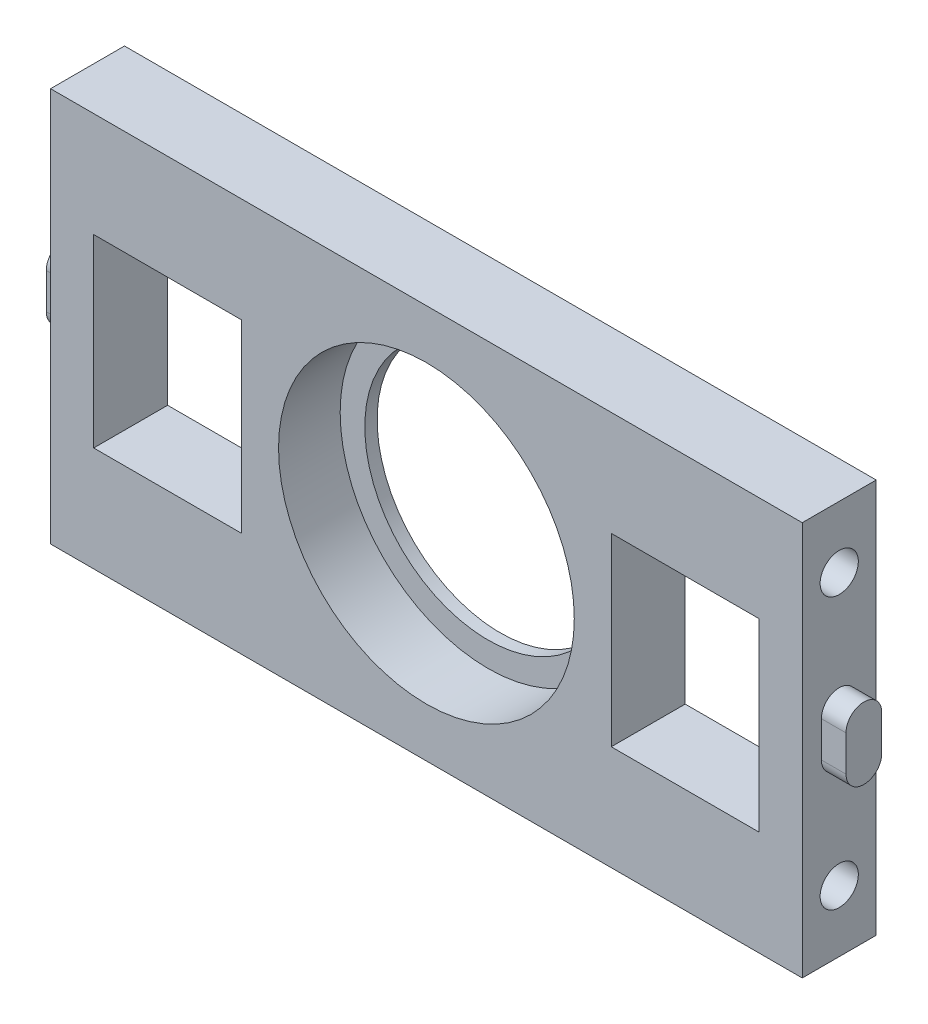
ISO-10303-21;
HEADER;
FILE_DESCRIPTION(('STEP AP214'),'2;1');
FILE_NAME('part.step','',(''),(''),'','','');
FILE_SCHEMA(('AUTOMOTIVE_DESIGN { 1 0 10303 214 1 1 1 1 }'));
ENDSEC;
DATA;
#1=APPLICATION_CONTEXT('core data for automotive mechanical design processes');
#2=APPLICATION_PROTOCOL_DEFINITION('international standard','automotive_design',2000,#1);
#3=PRODUCT_CONTEXT('',#1,'mechanical');
#4=PRODUCT('Part','Part','',(#3));
#5=PRODUCT_RELATED_PRODUCT_CATEGORY('part','',(#4));
#6=PRODUCT_DEFINITION_FORMATION('','',#4);
#7=PRODUCT_DEFINITION_CONTEXT('part definition',#1,'design');
#8=PRODUCT_DEFINITION('design','',#6,#7);
#9=PRODUCT_DEFINITION_SHAPE('','',#8);
#10=(LENGTH_UNIT() NAMED_UNIT(*) SI_UNIT(.MILLI.,.METRE.));
#11=(NAMED_UNIT(*) PLANE_ANGLE_UNIT() SI_UNIT($,.RADIAN.));
#12=(NAMED_UNIT(*) SI_UNIT($,.STERADIAN.) SOLID_ANGLE_UNIT());
#13=UNCERTAINTY_MEASURE_WITH_UNIT(LENGTH_MEASURE(1.E-05),#10,'distance_accuracy_value','');
#14=(GEOMETRIC_REPRESENTATION_CONTEXT(3) GLOBAL_UNCERTAINTY_ASSIGNED_CONTEXT((#13)) GLOBAL_UNIT_ASSIGNED_CONTEXT((#10,
#11,#12)) REPRESENTATION_CONTEXT('',''));
#15=CARTESIAN_POINT('',(0.,0.,0.));
#16=DIRECTION('',(0.,0.,1.));
#17=DIRECTION('',(1.,0.,0.));
#18=AXIS2_PLACEMENT_3D('',#15,#16,#17);
#19=CARTESIAN_POINT('',(30.5,16.,6.));
#20=DIRECTION('',(1.,0.,0.));
#21=DIRECTION('',(0.,1.,0.));
#22=AXIS2_PLACEMENT_3D('',#19,#20,#21);
#23=PLANE('',#22);
#24=CARTESIAN_POINT('',(30.5,-11.,3.));
#25=DIRECTION('',(1.,0.,0.));
#26=DIRECTION('',(0.,1.,0.));
#27=AXIS2_PLACEMENT_3D('',#24,#25,#26);
#28=CIRCLE('',#27,1.55);
#29=CARTESIAN_POINT('',(30.5,-9.44999999999999,3.));
#30=VERTEX_POINT('',#29);
#31=EDGE_CURVE('E652',#30,#30,#28,.T.);
#32=ORIENTED_EDGE('',*,*,#31,.F.);
#33=EDGE_LOOP('',(#32));
#34=FACE_BOUND('',#33,.T.);
#35=CARTESIAN_POINT('',(30.5,11.,3.));
#36=DIRECTION('',(1.,0.,0.));
#37=DIRECTION('',(0.,1.,0.));
#38=AXIS2_PLACEMENT_3D('',#35,#36,#37);
#39=CIRCLE('',#38,1.55);
#40=CARTESIAN_POINT('',(30.5,12.55,3.));
#41=VERTEX_POINT('',#40);
#42=EDGE_CURVE('E651',#41,#41,#39,.T.);
#43=ORIENTED_EDGE('',*,*,#42,.F.);
#44=EDGE_LOOP('',(#43));
#45=FACE_BOUND('',#44,.T.);
#46=DIRECTION('',(0.,-1.,0.));
#47=VECTOR('',#46,1.);
#48=CARTESIAN_POINT('',(30.5,16.,0.));
#49=LINE('',#48,#47);
#50=CARTESIAN_POINT('',(30.5,16.,0.));
#51=VERTEX_POINT('',#50);
#52=CARTESIAN_POINT('',(30.5,-16.,0.));
#53=VERTEX_POINT('',#52);
#54=EDGE_CURVE('E323',#51,#53,#49,.T.);
#55=ORIENTED_EDGE('',*,*,#54,.F.);
#56=DIRECTION('',(0.,0.,-1.));
#57=VECTOR('',#56,1.);
#58=CARTESIAN_POINT('',(30.5,16.,6.));
#59=LINE('',#58,#57);
#60=CARTESIAN_POINT('',(30.5,16.,6.));
#61=VERTEX_POINT('',#60);
#62=EDGE_CURVE('E329',#61,#51,#59,.T.);
#63=ORIENTED_EDGE('',*,*,#62,.F.);
#64=DIRECTION('',(0.,-1.,0.));
#65=VECTOR('',#64,1.);
#66=CARTESIAN_POINT('',(30.5,16.,6.));
#67=LINE('',#66,#65);
#68=CARTESIAN_POINT('',(30.5,-16.,6.));
#69=VERTEX_POINT('',#68);
#70=EDGE_CURVE('E311',#61,#69,#67,.T.);
#71=ORIENTED_EDGE('',*,*,#70,.T.);
#72=DIRECTION('',(0.,0.,-1.));
#73=VECTOR('',#72,1.);
#74=CARTESIAN_POINT('',(30.5,-16.,6.));
#75=LINE('',#74,#73);
#76=EDGE_CURVE('E45',#69,#53,#75,.T.);
#77=ORIENTED_EDGE('',*,*,#76,.T.);
#78=EDGE_LOOP('',(#55,#63,#71,#77));
#79=FACE_BOUND('',#78,.T.);
#80=DIRECTION('',(0.,-1.,0.));
#81=VECTOR('',#80,1.);
#82=CARTESIAN_POINT('',(30.5,1.45000000000001,4.45));
#83=LINE('',#82,#81);
#84=CARTESIAN_POINT('',(30.5,1.45000000000001,4.45));
#85=VERTEX_POINT('',#84);
#86=CARTESIAN_POINT('',(30.5,-1.44999999999999,4.45));
#87=VERTEX_POINT('',#86);
#88=EDGE_CURVE('E678',#85,#87,#83,.T.);
#89=ORIENTED_EDGE('',*,*,#88,.F.);
#90=CARTESIAN_POINT('',(30.5,1.45000000000001,3.));
#91=DIRECTION('',(1.,0.,0.));
#92=DIRECTION('',(0.,1.,0.));
#93=AXIS2_PLACEMENT_3D('',#90,#91,#92);
#94=CIRCLE('',#93,1.45);
#95=CARTESIAN_POINT('',(30.5,1.45000000000001,1.55));
#96=VERTEX_POINT('',#95);
#97=EDGE_CURVE('E197',#96,#85,#94,.T.);
#98=ORIENTED_EDGE('',*,*,#97,.F.);
#99=DIRECTION('',(0.,1.,0.));
#100=VECTOR('',#99,1.);
#101=CARTESIAN_POINT('',(30.5,1.45000000000001,1.55));
#102=LINE('',#101,#100);
#103=CARTESIAN_POINT('',(30.5,-1.44999999999999,1.55));
#104=VERTEX_POINT('',#103);
#105=EDGE_CURVE('E193',#104,#96,#102,.T.);
#106=ORIENTED_EDGE('',*,*,#105,.F.);
#107=CARTESIAN_POINT('',(30.5,-1.44999999999999,3.));
#108=DIRECTION('',(1.,0.,0.));
#109=DIRECTION('',(0.,1.,0.));
#110=AXIS2_PLACEMENT_3D('',#107,#108,#109);
#111=CIRCLE('',#110,1.45);
#112=EDGE_CURVE('E680',#87,#104,#111,.T.);
#113=ORIENTED_EDGE('',*,*,#112,.F.);
#114=EDGE_LOOP('',(#89,#98,#106,#113));
#115=FACE_BOUND('',#114,.T.);
#116=ADVANCED_FACE('F36',(#34,#45,#79,#115),#23,.T.);
#117=CARTESIAN_POINT('',(-30.5,16.,6.));
#118=DIRECTION('',(1.,0.,0.));
#119=DIRECTION('',(0.,1.,0.));
#120=AXIS2_PLACEMENT_3D('',#117,#118,#119);
#121=PLANE('',#120);
#122=CARTESIAN_POINT('',(-30.5,-11.,3.));
#123=DIRECTION('',(-1.,0.,0.));
#124=DIRECTION('',(0.,-1.,0.));
#125=AXIS2_PLACEMENT_3D('',#122,#123,#124);
#126=CIRCLE('',#125,1.55);
#127=CARTESIAN_POINT('',(-30.5,-12.55,3.));
#128=VERTEX_POINT('',#127);
#129=EDGE_CURVE('E661',#128,#128,#126,.T.);
#130=ORIENTED_EDGE('',*,*,#129,.F.);
#131=EDGE_LOOP('',(#130));
#132=FACE_BOUND('',#131,.T.);
#133=CARTESIAN_POINT('',(-30.5,9.99999999999999,3.));
#134=DIRECTION('',(-1.,0.,0.));
#135=DIRECTION('',(0.,-1.,0.));
#136=AXIS2_PLACEMENT_3D('',#133,#134,#135);
#137=CIRCLE('',#136,1.55);
#138=CARTESIAN_POINT('',(-30.5,8.44999999999999,3.));
#139=VERTEX_POINT('',#138);
#140=EDGE_CURVE('E666',#139,#139,#137,.T.);
#141=ORIENTED_EDGE('',*,*,#140,.F.);
#142=EDGE_LOOP('',(#141));
#143=FACE_BOUND('',#142,.T.);
#144=DIRECTION('',(0.,-1.,0.));
#145=VECTOR('',#144,1.);
#146=CARTESIAN_POINT('',(-30.5,16.,0.));
#147=LINE('',#146,#145);
#148=CARTESIAN_POINT('',(-30.5,16.,0.));
#149=VERTEX_POINT('',#148);
#150=CARTESIAN_POINT('',(-30.5,-16.,0.));
#151=VERTEX_POINT('',#150);
#152=EDGE_CURVE('E304',#149,#151,#147,.T.);
#153=ORIENTED_EDGE('',*,*,#152,.T.);
#154=DIRECTION('',(0.,0.,-1.));
#155=VECTOR('',#154,1.);
#156=CARTESIAN_POINT('',(-30.5,-16.,6.));
#157=LINE('',#156,#155);
#158=CARTESIAN_POINT('',(-30.5,-16.,6.));
#159=VERTEX_POINT('',#158);
#160=EDGE_CURVE('E11',#159,#151,#157,.T.);
#161=ORIENTED_EDGE('',*,*,#160,.F.);
#162=DIRECTION('',(0.,-1.,0.));
#163=VECTOR('',#162,1.);
#164=CARTESIAN_POINT('',(-30.5,16.,6.));
#165=LINE('',#164,#163);
#166=CARTESIAN_POINT('',(-30.5,16.,6.));
#167=VERTEX_POINT('',#166);
#168=EDGE_CURVE('E305',#167,#159,#165,.T.);
#169=ORIENTED_EDGE('',*,*,#168,.F.);
#170=DIRECTION('',(0.,0.,-1.));
#171=VECTOR('',#170,1.);
#172=CARTESIAN_POINT('',(-30.5,16.,6.));
#173=LINE('',#172,#171);
#174=EDGE_CURVE('E317',#167,#149,#173,.T.);
#175=ORIENTED_EDGE('',*,*,#174,.T.);
#176=EDGE_LOOP('',(#153,#161,#169,#175));
#177=FACE_BOUND('',#176,.T.);
#178=CARTESIAN_POINT('',(-30.5,-1.50000000000001,2.9));
#179=DIRECTION('',(-1.,0.,0.));
#180=DIRECTION('',(0.,-1.,0.));
#181=AXIS2_PLACEMENT_3D('',#178,#179,#180);
#182=CIRCLE('',#181,1.45);
#183=CARTESIAN_POINT('',(-30.5,-1.50000000000001,1.45));
#184=VERTEX_POINT('',#183);
#185=CARTESIAN_POINT('',(-30.5,-1.5,4.35));
#186=VERTEX_POINT('',#185);
#187=EDGE_CURVE('E199',#184,#186,#182,.T.);
#188=ORIENTED_EDGE('',*,*,#187,.F.);
#189=DIRECTION('',(0.,-1.,0.));
#190=VECTOR('',#189,1.);
#191=CARTESIAN_POINT('',(-30.5,-1.50000000000001,1.45));
#192=LINE('',#191,#190);
#193=CARTESIAN_POINT('',(-30.5,1.39999999999999,1.45));
#194=VERTEX_POINT('',#193);
#195=EDGE_CURVE('E210',#194,#184,#192,.T.);
#196=ORIENTED_EDGE('',*,*,#195,.F.);
#197=CARTESIAN_POINT('',(-30.5,1.39999999999999,2.9));
#198=DIRECTION('',(-1.,0.,0.));
#199=DIRECTION('',(0.,-1.,0.));
#200=AXIS2_PLACEMENT_3D('',#197,#198,#199);
#201=CIRCLE('',#200,1.45);
#202=CARTESIAN_POINT('',(-30.5,1.39999999999999,4.35));
#203=VERTEX_POINT('',#202);
#204=EDGE_CURVE('E218',#203,#194,#201,.T.);
#205=ORIENTED_EDGE('',*,*,#204,.F.);
#206=DIRECTION('',(0.,1.,0.));
#207=VECTOR('',#206,1.);
#208=CARTESIAN_POINT('',(-30.5,-1.50000000000001,4.35));
#209=LINE('',#208,#207);
#210=EDGE_CURVE('E60',#186,#203,#209,.T.);
#211=ORIENTED_EDGE('',*,*,#210,.F.);
#212=EDGE_LOOP('',(#188,#196,#205,#211));
#213=FACE_BOUND('',#212,.T.);
#214=ADVANCED_FACE('F38',(#132,#143,#177,#213),#121,.F.);
#215=CARTESIAN_POINT('',(0.,0.,6.));
#216=DIRECTION('',(0.,0.,1.));
#217=DIRECTION('',(1.,0.,0.));
#218=AXIS2_PLACEMENT_3D('',#215,#216,#217);
#219=PLANE('',#218);
#220=DIRECTION('',(1.,0.,0.));
#221=VECTOR('',#220,1.);
#222=CARTESIAN_POINT('',(0.,7.5,6.));
#223=LINE('',#222,#221);
#224=CARTESIAN_POINT('',(15.,7.5,6.));
#225=VERTEX_POINT('',#224);
#226=CARTESIAN_POINT('',(27.,7.5,6.));
#227=VERTEX_POINT('',#226);
#228=EDGE_CURVE('E279',#225,#227,#223,.T.);
#229=ORIENTED_EDGE('',*,*,#228,.T.);
#230=DIRECTION('',(0.,-1.,0.));
#231=VECTOR('',#230,1.);
#232=CARTESIAN_POINT('',(27.,0.,6.));
#233=LINE('',#232,#231);
#234=CARTESIAN_POINT('',(27.,-7.5,6.));
#235=VERTEX_POINT('',#234);
#236=EDGE_CURVE('E258',#227,#235,#233,.T.);
#237=ORIENTED_EDGE('',*,*,#236,.T.);
#238=DIRECTION('',(1.,0.,0.));
#239=VECTOR('',#238,1.);
#240=CARTESIAN_POINT('',(0.,-7.5,6.));
#241=LINE('',#240,#239);
#242=CARTESIAN_POINT('',(15.,-7.5,6.));
#243=VERTEX_POINT('',#242);
#244=EDGE_CURVE('E268',#243,#235,#241,.T.);
#245=ORIENTED_EDGE('',*,*,#244,.F.);
#246=DIRECTION('',(0.,-1.,0.));
#247=VECTOR('',#246,1.);
#248=CARTESIAN_POINT('',(15.,0.,6.));
#249=LINE('',#248,#247);
#250=EDGE_CURVE('E282',#225,#243,#249,.T.);
#251=ORIENTED_EDGE('',*,*,#250,.F.);
#252=EDGE_LOOP('',(#229,#237,#245,#251));
#253=FACE_BOUND('',#252,.T.);
#254=CARTESIAN_POINT('',(0.,0.,6.));
#255=DIRECTION('',(0.,0.,1.));
#256=DIRECTION('',(1.,0.,0.));
#257=AXIS2_PLACEMENT_3D('',#254,#255,#256);
#258=CIRCLE('',#257,12.);
#259=CARTESIAN_POINT('',(12.,0.,6.));
#260=VERTEX_POINT('',#259);
#261=EDGE_CURVE('E289',#260,#260,#258,.T.);
#262=ORIENTED_EDGE('',*,*,#261,.F.);
#263=EDGE_LOOP('',(#262));
#264=FACE_BOUND('',#263,.T.);
#265=ORIENTED_EDGE('',*,*,#168,.T.);
#266=DIRECTION('',(1.,0.,0.));
#267=VECTOR('',#266,1.);
#268=CARTESIAN_POINT('',(-30.5,-16.,6.));
#269=LINE('',#268,#267);
#270=EDGE_CURVE('E308',#159,#69,#269,.T.);
#271=ORIENTED_EDGE('',*,*,#270,.T.);
#272=ORIENTED_EDGE('',*,*,#70,.F.);
#273=DIRECTION('',(1.,0.,0.));
#274=VECTOR('',#273,1.);
#275=CARTESIAN_POINT('',(-30.5,16.,6.));
#276=LINE('',#275,#274);
#277=EDGE_CURVE('E314',#167,#61,#276,.T.);
#278=ORIENTED_EDGE('',*,*,#277,.F.);
#279=EDGE_LOOP('',(#265,#271,#272,#278));
#280=FACE_BOUND('',#279,.T.);
#281=DIRECTION('',(-1.,0.,0.));
#282=VECTOR('',#281,1.);
#283=CARTESIAN_POINT('',(0.,-7.5,6.));
#284=LINE('',#283,#282);
#285=CARTESIAN_POINT('',(-15.,-7.5,6.));
#286=VERTEX_POINT('',#285);
#287=CARTESIAN_POINT('',(-27.,-7.50000000000001,6.));
#288=VERTEX_POINT('',#287);
#289=EDGE_CURVE('E248',#286,#288,#284,.T.);
#290=ORIENTED_EDGE('',*,*,#289,.T.);
#291=DIRECTION('',(0.,1.,0.));
#292=VECTOR('',#291,1.);
#293=CARTESIAN_POINT('',(-27.,0.,6.));
#294=LINE('',#293,#292);
#295=CARTESIAN_POINT('',(-27.,7.5,6.));
#296=VERTEX_POINT('',#295);
#297=EDGE_CURVE('E233',#288,#296,#294,.T.);
#298=ORIENTED_EDGE('',*,*,#297,.T.);
#299=DIRECTION('',(-1.,0.,0.));
#300=VECTOR('',#299,1.);
#301=CARTESIAN_POINT('',(0.,7.5,6.));
#302=LINE('',#301,#300);
#303=CARTESIAN_POINT('',(-15.,7.5,6.));
#304=VERTEX_POINT('',#303);
#305=EDGE_CURVE('E237',#304,#296,#302,.T.);
#306=ORIENTED_EDGE('',*,*,#305,.F.);
#307=DIRECTION('',(0.,1.,0.));
#308=VECTOR('',#307,1.);
#309=CARTESIAN_POINT('',(-15.,0.,6.));
#310=LINE('',#309,#308);
#311=EDGE_CURVE('E251',#286,#304,#310,.T.);
#312=ORIENTED_EDGE('',*,*,#311,.F.);
#313=EDGE_LOOP('',(#290,#298,#306,#312));
#314=FACE_BOUND('',#313,.T.);
#315=ADVANCED_FACE('F349',(#253,#264,#280,#314),#219,.T.);
#316=CARTESIAN_POINT('',(0.,0.,0.));
#317=DIRECTION('',(0.,0.,1.));
#318=DIRECTION('',(1.,0.,0.));
#319=AXIS2_PLACEMENT_3D('',#316,#317,#318);
#320=PLANE('',#319);
#321=DIRECTION('',(0.,-1.,0.));
#322=VECTOR('',#321,1.);
#323=CARTESIAN_POINT('',(27.,0.,0.));
#324=LINE('',#323,#322);
#325=CARTESIAN_POINT('',(27.,7.5,0.));
#326=VERTEX_POINT('',#325);
#327=CARTESIAN_POINT('',(27.,-7.5,0.));
#328=VERTEX_POINT('',#327);
#329=EDGE_CURVE('E265',#326,#328,#324,.T.);
#330=ORIENTED_EDGE('',*,*,#329,.F.);
#331=DIRECTION('',(1.,0.,0.));
#332=VECTOR('',#331,1.);
#333=CARTESIAN_POINT('',(0.,7.5,0.));
#334=LINE('',#333,#332);
#335=CARTESIAN_POINT('',(15.,7.5,0.));
#336=VERTEX_POINT('',#335);
#337=EDGE_CURVE('E267',#336,#326,#334,.T.);
#338=ORIENTED_EDGE('',*,*,#337,.F.);
#339=DIRECTION('',(0.,-1.,0.));
#340=VECTOR('',#339,1.);
#341=CARTESIAN_POINT('',(15.,0.,0.));
#342=LINE('',#341,#340);
#343=CARTESIAN_POINT('',(15.,-7.5,0.));
#344=VERTEX_POINT('',#343);
#345=EDGE_CURVE('E270',#336,#344,#342,.T.);
#346=ORIENTED_EDGE('',*,*,#345,.T.);
#347=DIRECTION('',(1.,0.,0.));
#348=VECTOR('',#347,1.);
#349=CARTESIAN_POINT('',(0.,-7.5,0.));
#350=LINE('',#349,#348);
#351=EDGE_CURVE('E273',#344,#328,#350,.T.);
#352=ORIENTED_EDGE('',*,*,#351,.T.);
#353=EDGE_LOOP('',(#330,#338,#346,#352));
#354=FACE_BOUND('',#353,.T.);
#355=CARTESIAN_POINT('',(0.,0.,0.));
#356=DIRECTION('',(0.,0.,1.));
#357=DIRECTION('',(1.,0.,0.));
#358=AXIS2_PLACEMENT_3D('',#355,#356,#357);
#359=CIRCLE('',#358,10.);
#360=CARTESIAN_POINT('',(10.,0.,0.));
#361=VERTEX_POINT('',#360);
#362=EDGE_CURVE('E301',#361,#361,#359,.T.);
#363=ORIENTED_EDGE('',*,*,#362,.T.);
#364=EDGE_LOOP('',(#363));
#365=FACE_BOUND('',#364,.T.);
#366=ORIENTED_EDGE('',*,*,#152,.F.);
#367=DIRECTION('',(1.,0.,0.));
#368=VECTOR('',#367,1.);
#369=CARTESIAN_POINT('',(-30.5,16.,0.));
#370=LINE('',#369,#368);
#371=EDGE_CURVE('E309',#149,#51,#370,.T.);
#372=ORIENTED_EDGE('',*,*,#371,.T.);
#373=ORIENTED_EDGE('',*,*,#54,.T.);
#374=DIRECTION('',(1.,0.,0.));
#375=VECTOR('',#374,1.);
#376=CARTESIAN_POINT('',(-30.5,-16.,0.));
#377=LINE('',#376,#375);
#378=EDGE_CURVE('E320',#151,#53,#377,.T.);
#379=ORIENTED_EDGE('',*,*,#378,.F.);
#380=EDGE_LOOP('',(#366,#372,#373,#379));
#381=FACE_BOUND('',#380,.T.);
#382=DIRECTION('',(0.,1.,0.));
#383=VECTOR('',#382,1.);
#384=CARTESIAN_POINT('',(-27.,0.,0.));
#385=LINE('',#384,#383);
#386=CARTESIAN_POINT('',(-27.,-7.50000000000001,0.));
#387=VERTEX_POINT('',#386);
#388=CARTESIAN_POINT('',(-27.,7.5,0.));
#389=VERTEX_POINT('',#388);
#390=EDGE_CURVE('E234',#387,#389,#385,.T.);
#391=ORIENTED_EDGE('',*,*,#390,.F.);
#392=DIRECTION('',(-1.,0.,0.));
#393=VECTOR('',#392,1.);
#394=CARTESIAN_POINT('',(0.,-7.5,0.));
#395=LINE('',#394,#393);
#396=CARTESIAN_POINT('',(-15.,-7.5,0.));
#397=VERTEX_POINT('',#396);
#398=EDGE_CURVE('E236',#397,#387,#395,.T.);
#399=ORIENTED_EDGE('',*,*,#398,.F.);
#400=DIRECTION('',(0.,1.,0.));
#401=VECTOR('',#400,1.);
#402=CARTESIAN_POINT('',(-15.,0.,0.));
#403=LINE('',#402,#401);
#404=CARTESIAN_POINT('',(-15.,7.5,0.));
#405=VERTEX_POINT('',#404);
#406=EDGE_CURVE('E239',#397,#405,#403,.T.);
#407=ORIENTED_EDGE('',*,*,#406,.T.);
#408=DIRECTION('',(-1.,0.,0.));
#409=VECTOR('',#408,1.);
#410=CARTESIAN_POINT('',(0.,7.5,0.));
#411=LINE('',#410,#409);
#412=EDGE_CURVE('E242',#405,#389,#411,.T.);
#413=ORIENTED_EDGE('',*,*,#412,.T.);
#414=EDGE_LOOP('',(#391,#399,#407,#413));
#415=FACE_BOUND('',#414,.T.);
#416=ADVANCED_FACE('F341',(#354,#365,#381,#415),#320,.F.);
#417=CARTESIAN_POINT('',(0.,0.,0.));
#418=DIRECTION('',(0.,0.,1.));
#419=DIRECTION('',(1.,0.,0.));
#420=AXIS2_PLACEMENT_3D('',#417,#418,#419);
#421=CYLINDRICAL_SURFACE('',#420,10.);
#422=ORIENTED_EDGE('',*,*,#362,.F.);
#423=EDGE_LOOP('',(#422));
#424=FACE_BOUND('',#423,.T.);
#425=CARTESIAN_POINT('',(0.,0.,1.));
#426=DIRECTION('',(0.,0.,1.));
#427=DIRECTION('',(1.,0.,0.));
#428=AXIS2_PLACEMENT_3D('',#425,#426,#427);
#429=CIRCLE('',#428,10.);
#430=CARTESIAN_POINT('',(10.,0.,1.));
#431=VERTEX_POINT('',#430);
#432=EDGE_CURVE('E40',#431,#431,#429,.F.);
#433=ORIENTED_EDGE('',*,*,#432,.F.);
#434=EDGE_LOOP('',(#433));
#435=FACE_BOUND('',#434,.T.);
#436=ADVANCED_FACE('F390',(#424,#435),#421,.F.);
#437=CARTESIAN_POINT('',(-30.5,-16.,6.));
#438=DIRECTION('',(0.,1.,0.));
#439=DIRECTION('',(0.,0.,1.));
#440=AXIS2_PLACEMENT_3D('',#437,#438,#439);
#441=PLANE('',#440);
#442=ORIENTED_EDGE('',*,*,#378,.T.);
#443=ORIENTED_EDGE('',*,*,#76,.F.);
#444=ORIENTED_EDGE('',*,*,#270,.F.);
#445=ORIENTED_EDGE('',*,*,#160,.T.);
#446=EDGE_LOOP('',(#442,#443,#444,#445));
#447=FACE_BOUND('',#446,.T.);
#448=ADVANCED_FACE('F337',(#447),#441,.F.);
#449=CARTESIAN_POINT('',(-30.5,16.,6.));
#450=DIRECTION('',(0.,1.,0.));
#451=DIRECTION('',(0.,0.,1.));
#452=AXIS2_PLACEMENT_3D('',#449,#450,#451);
#453=PLANE('',#452);
#454=ORIENTED_EDGE('',*,*,#371,.F.);
#455=ORIENTED_EDGE('',*,*,#174,.F.);
#456=ORIENTED_EDGE('',*,*,#277,.T.);
#457=ORIENTED_EDGE('',*,*,#62,.T.);
#458=EDGE_LOOP('',(#454,#455,#456,#457));
#459=FACE_BOUND('',#458,.T.);
#460=ADVANCED_FACE('F345',(#459),#453,.T.);
#461=CARTESIAN_POINT('',(0.,0.,1.));
#462=DIRECTION('',(0.,0.,1.));
#463=DIRECTION('',(1.,0.,0.));
#464=AXIS2_PLACEMENT_3D('',#461,#462,#463);
#465=PLANE('',#464);
#466=CARTESIAN_POINT('',(0.,0.,1.));
#467=DIRECTION('',(0.,0.,1.));
#468=DIRECTION('',(1.,0.,0.));
#469=AXIS2_PLACEMENT_3D('',#466,#467,#468);
#470=CIRCLE('',#469,12.);
#471=CARTESIAN_POINT('',(12.,0.,1.));
#472=VERTEX_POINT('',#471);
#473=EDGE_CURVE('E296',#472,#472,#470,.T.);
#474=ORIENTED_EDGE('',*,*,#473,.T.);
#475=EDGE_LOOP('',(#474));
#476=FACE_BOUND('',#475,.T.);
#477=ORIENTED_EDGE('',*,*,#432,.T.);
#478=EDGE_LOOP('',(#477));
#479=FACE_BOUND('',#478,.T.);
#480=ADVANCED_FACE('F395',(#476,#479),#465,.T.);
#481=CARTESIAN_POINT('',(0.,0.,1.));
#482=DIRECTION('',(0.,0.,1.));
#483=DIRECTION('',(1.,0.,0.));
#484=AXIS2_PLACEMENT_3D('',#481,#482,#483);
#485=CYLINDRICAL_SURFACE('',#484,12.);
#486=ORIENTED_EDGE('',*,*,#473,.F.);
#487=EDGE_LOOP('',(#486));
#488=FACE_BOUND('',#487,.T.);
#489=ORIENTED_EDGE('',*,*,#261,.T.);
#490=EDGE_LOOP('',(#489));
#491=FACE_BOUND('',#490,.T.);
#492=ADVANCED_FACE('F406',(#488,#491),#485,.F.);
#493=CARTESIAN_POINT('',(27.,0.,0.));
#494=DIRECTION('',(-1.,0.,0.));
#495=DIRECTION('',(0.,-1.,0.));
#496=AXIS2_PLACEMENT_3D('',#493,#494,#495);
#497=PLANE('',#496);
#498=ORIENTED_EDGE('',*,*,#236,.F.);
#499=DIRECTION('',(0.,0.,1.));
#500=VECTOR('',#499,1.);
#501=CARTESIAN_POINT('',(27.,7.5,0.));
#502=LINE('',#501,#500);
#503=EDGE_CURVE('E276',#326,#227,#502,.T.);
#504=ORIENTED_EDGE('',*,*,#503,.F.);
#505=ORIENTED_EDGE('',*,*,#329,.T.);
#506=DIRECTION('',(0.,0.,1.));
#507=VECTOR('',#506,1.);
#508=CARTESIAN_POINT('',(27.,-7.5,0.));
#509=LINE('',#508,#507);
#510=EDGE_CURVE('E287',#328,#235,#509,.T.);
#511=ORIENTED_EDGE('',*,*,#510,.T.);
#512=EDGE_LOOP('',(#498,#504,#505,#511));
#513=FACE_BOUND('',#512,.T.);
#514=ADVANCED_FACE('F418',(#513),#497,.T.);
#515=CARTESIAN_POINT('',(0.,-7.5,0.));
#516=DIRECTION('',(0.,-1.,0.));
#517=DIRECTION('',(0.,0.,-1.));
#518=AXIS2_PLACEMENT_3D('',#515,#516,#517);
#519=PLANE('',#518);
#520=ORIENTED_EDGE('',*,*,#244,.T.);
#521=ORIENTED_EDGE('',*,*,#510,.F.);
#522=ORIENTED_EDGE('',*,*,#351,.F.);
#523=DIRECTION('',(0.,0.,1.));
#524=VECTOR('',#523,1.);
#525=CARTESIAN_POINT('',(15.,-7.5,0.));
#526=LINE('',#525,#524);
#527=EDGE_CURVE('E290',#344,#243,#526,.T.);
#528=ORIENTED_EDGE('',*,*,#527,.T.);
#529=EDGE_LOOP('',(#520,#521,#522,#528));
#530=FACE_BOUND('',#529,.T.);
#531=ADVANCED_FACE('F424',(#530),#519,.F.);
#532=CARTESIAN_POINT('',(15.,0.,0.));
#533=DIRECTION('',(-1.,0.,0.));
#534=DIRECTION('',(0.,-1.,0.));
#535=AXIS2_PLACEMENT_3D('',#532,#533,#534);
#536=PLANE('',#535);
#537=ORIENTED_EDGE('',*,*,#250,.T.);
#538=ORIENTED_EDGE('',*,*,#527,.F.);
#539=ORIENTED_EDGE('',*,*,#345,.F.);
#540=DIRECTION('',(0.,0.,1.));
#541=VECTOR('',#540,1.);
#542=CARTESIAN_POINT('',(15.,7.5,0.));
#543=LINE('',#542,#541);
#544=EDGE_CURVE('E292',#336,#225,#543,.T.);
#545=ORIENTED_EDGE('',*,*,#544,.T.);
#546=EDGE_LOOP('',(#537,#538,#539,#545));
#547=FACE_BOUND('',#546,.T.);
#548=ADVANCED_FACE('F439',(#547),#536,.F.);
#549=CARTESIAN_POINT('',(0.,7.5,0.));
#550=DIRECTION('',(0.,-1.,0.));
#551=DIRECTION('',(0.,0.,-1.));
#552=AXIS2_PLACEMENT_3D('',#549,#550,#551);
#553=PLANE('',#552);
#554=ORIENTED_EDGE('',*,*,#228,.F.);
#555=ORIENTED_EDGE('',*,*,#544,.F.);
#556=ORIENTED_EDGE('',*,*,#337,.T.);
#557=ORIENTED_EDGE('',*,*,#503,.T.);
#558=EDGE_LOOP('',(#554,#555,#556,#557));
#559=FACE_BOUND('',#558,.T.);
#560=ADVANCED_FACE('F435',(#559),#553,.T.);
#561=CARTESIAN_POINT('',(-27.,0.,0.));
#562=DIRECTION('',(1.,0.,0.));
#563=DIRECTION('',(0.,0.,-1.));
#564=AXIS2_PLACEMENT_3D('',#561,#562,#563);
#565=PLANE('',#564);
#566=ORIENTED_EDGE('',*,*,#297,.F.);
#567=DIRECTION('',(0.,0.,1.));
#568=VECTOR('',#567,1.);
#569=CARTESIAN_POINT('',(-27.,-7.50000000000001,0.));
#570=LINE('',#569,#568);
#571=EDGE_CURVE('E245',#387,#288,#570,.T.);
#572=ORIENTED_EDGE('',*,*,#571,.F.);
#573=ORIENTED_EDGE('',*,*,#390,.T.);
#574=DIRECTION('',(0.,0.,1.));
#575=VECTOR('',#574,1.);
#576=CARTESIAN_POINT('',(-27.,7.5,0.));
#577=LINE('',#576,#575);
#578=EDGE_CURVE('E256',#389,#296,#577,.T.);
#579=ORIENTED_EDGE('',*,*,#578,.T.);
#580=EDGE_LOOP('',(#566,#572,#573,#579));
#581=FACE_BOUND('',#580,.T.);
#582=ADVANCED_FACE('F438',(#581),#565,.T.);
#583=CARTESIAN_POINT('',(0.,7.5,0.));
#584=DIRECTION('',(0.,1.,0.));
#585=DIRECTION('',(0.,0.,1.));
#586=AXIS2_PLACEMENT_3D('',#583,#584,#585);
#587=PLANE('',#586);
#588=ORIENTED_EDGE('',*,*,#305,.T.);
#589=ORIENTED_EDGE('',*,*,#578,.F.);
#590=ORIENTED_EDGE('',*,*,#412,.F.);
#591=DIRECTION('',(0.,0.,1.));
#592=VECTOR('',#591,1.);
#593=CARTESIAN_POINT('',(-15.,7.5,0.));
#594=LINE('',#593,#592);
#595=EDGE_CURVE('E259',#405,#304,#594,.T.);
#596=ORIENTED_EDGE('',*,*,#595,.T.);
#597=EDGE_LOOP('',(#588,#589,#590,#596));
#598=FACE_BOUND('',#597,.T.);
#599=ADVANCED_FACE('F449',(#598),#587,.F.);
#600=CARTESIAN_POINT('',(-15.,0.,0.));
#601=DIRECTION('',(1.,0.,0.));
#602=DIRECTION('',(0.,0.,-1.));
#603=AXIS2_PLACEMENT_3D('',#600,#601,#602);
#604=PLANE('',#603);
#605=ORIENTED_EDGE('',*,*,#311,.T.);
#606=ORIENTED_EDGE('',*,*,#595,.F.);
#607=ORIENTED_EDGE('',*,*,#406,.F.);
#608=DIRECTION('',(0.,0.,1.));
#609=VECTOR('',#608,1.);
#610=CARTESIAN_POINT('',(-15.,-7.5,0.));
#611=LINE('',#610,#609);
#612=EDGE_CURVE('E261',#397,#286,#611,.T.);
#613=ORIENTED_EDGE('',*,*,#612,.T.);
#614=EDGE_LOOP('',(#605,#606,#607,#613));
#615=FACE_BOUND('',#614,.T.);
#616=ADVANCED_FACE('F453',(#615),#604,.F.);
#617=CARTESIAN_POINT('',(0.,-7.5,0.));
#618=DIRECTION('',(0.,1.,0.));
#619=DIRECTION('',(-1.,0.,0.));
#620=AXIS2_PLACEMENT_3D('',#617,#618,#619);
#621=PLANE('',#620);
#622=ORIENTED_EDGE('',*,*,#289,.F.);
#623=ORIENTED_EDGE('',*,*,#612,.F.);
#624=ORIENTED_EDGE('',*,*,#398,.T.);
#625=ORIENTED_EDGE('',*,*,#571,.T.);
#626=EDGE_LOOP('',(#622,#623,#624,#625));
#627=FACE_BOUND('',#626,.T.);
#628=ADVANCED_FACE('F378',(#627),#621,.T.);
#629=CARTESIAN_POINT('',(-32.5,-1.50000000000001,2.9));
#630=DIRECTION('',(1.,0.,0.));
#631=DIRECTION('',(0.,1.,0.));
#632=AXIS2_PLACEMENT_3D('',#629,#630,#631);
#633=CYLINDRICAL_SURFACE('',#632,1.45);
#634=ORIENTED_EDGE('',*,*,#187,.T.);
#635=DIRECTION('',(1.,0.,0.));
#636=VECTOR('',#635,1.);
#637=CARTESIAN_POINT('',(-32.5,-1.50000000000001,4.35));
#638=LINE('',#637,#636);
#639=CARTESIAN_POINT('',(-32.5,-1.50000000000001,4.35));
#640=VERTEX_POINT('',#639);
#641=EDGE_CURVE('E231',#640,#186,#638,.T.);
#642=ORIENTED_EDGE('',*,*,#641,.F.);
#643=CARTESIAN_POINT('',(-32.5,-1.50000000000001,2.9));
#644=DIRECTION('',(-1.,0.,0.));
#645=DIRECTION('',(0.,-1.,0.));
#646=AXIS2_PLACEMENT_3D('',#643,#644,#645);
#647=CIRCLE('',#646,1.45);
#648=CARTESIAN_POINT('',(-32.5,-1.50000000000001,1.45));
#649=VERTEX_POINT('',#648);
#650=EDGE_CURVE('E206',#649,#640,#647,.T.);
#651=ORIENTED_EDGE('',*,*,#650,.F.);
#652=DIRECTION('',(1.,0.,0.));
#653=VECTOR('',#652,1.);
#654=CARTESIAN_POINT('',(-32.5,-1.50000000000001,1.45));
#655=LINE('',#654,#653);
#656=EDGE_CURVE('E215',#649,#184,#655,.T.);
#657=ORIENTED_EDGE('',*,*,#656,.T.);
#658=EDGE_LOOP('',(#634,#642,#651,#657));
#659=FACE_BOUND('',#658,.T.);
#660=ADVANCED_FACE('F362',(#659),#633,.T.);
#661=CARTESIAN_POINT('',(-32.5,-1.50000000000001,4.35));
#662=DIRECTION('',(0.,0.,-1.));
#663=DIRECTION('',(0.,1.,0.));
#664=AXIS2_PLACEMENT_3D('',#661,#662,#663);
#665=PLANE('',#664);
#666=ORIENTED_EDGE('',*,*,#210,.T.);
#667=DIRECTION('',(1.,0.,0.));
#668=VECTOR('',#667,1.);
#669=CARTESIAN_POINT('',(-32.5,1.39999999999999,4.35));
#670=LINE('',#669,#668);
#671=CARTESIAN_POINT('',(-32.5,1.39999999999999,4.35));
#672=VERTEX_POINT('',#671);
#673=EDGE_CURVE('E228',#672,#203,#670,.T.);
#674=ORIENTED_EDGE('',*,*,#673,.F.);
#675=DIRECTION('',(0.,1.,0.));
#676=VECTOR('',#675,1.);
#677=CARTESIAN_POINT('',(-32.5,-1.50000000000001,4.35));
#678=LINE('',#677,#676);
#679=EDGE_CURVE('E209',#640,#672,#678,.T.);
#680=ORIENTED_EDGE('',*,*,#679,.F.);
#681=ORIENTED_EDGE('',*,*,#641,.T.);
#682=EDGE_LOOP('',(#666,#674,#680,#681));
#683=FACE_BOUND('',#682,.T.);
#684=ADVANCED_FACE('F370',(#683),#665,.F.);
#685=CARTESIAN_POINT('',(-32.5,1.39999999999999,2.9));
#686=DIRECTION('',(1.,0.,0.));
#687=DIRECTION('',(0.,1.,0.));
#688=AXIS2_PLACEMENT_3D('',#685,#686,#687);
#689=CYLINDRICAL_SURFACE('',#688,1.45);
#690=ORIENTED_EDGE('',*,*,#204,.T.);
#691=DIRECTION('',(1.,0.,0.));
#692=VECTOR('',#691,1.);
#693=CARTESIAN_POINT('',(-32.5,1.39999999999999,1.45));
#694=LINE('',#693,#692);
#695=CARTESIAN_POINT('',(-32.5,1.39999999999999,1.45));
#696=VERTEX_POINT('',#695);
#697=EDGE_CURVE('E225',#696,#194,#694,.T.);
#698=ORIENTED_EDGE('',*,*,#697,.F.);
#699=CARTESIAN_POINT('',(-32.5,1.39999999999999,2.9));
#700=DIRECTION('',(-1.,0.,0.));
#701=DIRECTION('',(0.,-1.,0.));
#702=AXIS2_PLACEMENT_3D('',#699,#700,#701);
#703=CIRCLE('',#702,1.45);
#704=EDGE_CURVE('E212',#672,#696,#703,.T.);
#705=ORIENTED_EDGE('',*,*,#704,.F.);
#706=ORIENTED_EDGE('',*,*,#673,.T.);
#707=EDGE_LOOP('',(#690,#698,#705,#706));
#708=FACE_BOUND('',#707,.T.);
#709=ADVANCED_FACE('F368',(#708),#689,.T.);
#710=CARTESIAN_POINT('',(-32.5,-1.50000000000001,1.45));
#711=DIRECTION('',(0.,0.,1.));
#712=DIRECTION('',(0.,-1.,0.));
#713=AXIS2_PLACEMENT_3D('',#710,#711,#712);
#714=PLANE('',#713);
#715=ORIENTED_EDGE('',*,*,#195,.T.);
#716=ORIENTED_EDGE('',*,*,#656,.F.);
#717=DIRECTION('',(0.,-1.,0.));
#718=VECTOR('',#717,1.);
#719=CARTESIAN_POINT('',(-32.5,-1.50000000000001,1.45));
#720=LINE('',#719,#718);
#721=EDGE_CURVE('E214',#696,#649,#720,.T.);
#722=ORIENTED_EDGE('',*,*,#721,.F.);
#723=ORIENTED_EDGE('',*,*,#697,.T.);
#724=EDGE_LOOP('',(#715,#716,#722,#723));
#725=FACE_BOUND('',#724,.T.);
#726=ADVANCED_FACE('F358',(#725),#714,.F.);
#727=CARTESIAN_POINT('',(-32.5,-1.50000000000001,2.9));
#728=DIRECTION('',(-1.,0.,0.));
#729=DIRECTION('',(0.,-1.,0.));
#730=AXIS2_PLACEMENT_3D('',#727,#728,#729);
#731=PLANE('',#730);
#732=ORIENTED_EDGE('',*,*,#650,.T.);
#733=ORIENTED_EDGE('',*,*,#679,.T.);
#734=ORIENTED_EDGE('',*,*,#704,.T.);
#735=ORIENTED_EDGE('',*,*,#721,.T.);
#736=EDGE_LOOP('',(#732,#733,#734,#735));
#737=FACE_BOUND('',#736,.T.);
#738=ADVANCED_FACE('F364',(#737),#731,.T.);
#739=CARTESIAN_POINT('',(32.5,1.45000000000001,3.));
#740=DIRECTION('',(-1.,0.,0.));
#741=DIRECTION('',(0.,-1.,0.));
#742=AXIS2_PLACEMENT_3D('',#739,#740,#741);
#743=CYLINDRICAL_SURFACE('',#742,1.45);
#744=ORIENTED_EDGE('',*,*,#97,.T.);
#745=DIRECTION('',(-1.,0.,0.));
#746=VECTOR('',#745,1.);
#747=CARTESIAN_POINT('',(32.5,1.45000000000001,4.45));
#748=LINE('',#747,#746);
#749=CARTESIAN_POINT('',(32.5,1.45000000000001,4.45));
#750=VERTEX_POINT('',#749);
#751=EDGE_CURVE('E178',#750,#85,#748,.T.);
#752=ORIENTED_EDGE('',*,*,#751,.F.);
#753=CARTESIAN_POINT('',(32.5,1.45000000000001,3.));
#754=DIRECTION('',(1.,0.,0.));
#755=DIRECTION('',(0.,1.,0.));
#756=AXIS2_PLACEMENT_3D('',#753,#754,#755);
#757=CIRCLE('',#756,1.45);
#758=CARTESIAN_POINT('',(32.5,1.45000000000001,1.55));
#759=VERTEX_POINT('',#758);
#760=EDGE_CURVE('E185',#759,#750,#757,.T.);
#761=ORIENTED_EDGE('',*,*,#760,.F.);
#762=DIRECTION('',(-1.,0.,0.));
#763=VECTOR('',#762,1.);
#764=CARTESIAN_POINT('',(32.5,1.45000000000001,1.55));
#765=LINE('',#764,#763);
#766=EDGE_CURVE('E676',#759,#96,#765,.T.);
#767=ORIENTED_EDGE('',*,*,#766,.T.);
#768=EDGE_LOOP('',(#744,#752,#761,#767));
#769=FACE_BOUND('',#768,.T.);
#770=ADVANCED_FACE('F195',(#769),#743,.T.);
#771=CARTESIAN_POINT('',(32.5,1.45000000000001,4.45));
#772=DIRECTION('',(0.,0.,-1.));
#773=DIRECTION('',(0.,1.,0.));
#774=AXIS2_PLACEMENT_3D('',#771,#772,#773);
#775=PLANE('',#774);
#776=ORIENTED_EDGE('',*,*,#88,.T.);
#777=DIRECTION('',(-1.,0.,0.));
#778=VECTOR('',#777,1.);
#779=CARTESIAN_POINT('',(32.5,-1.44999999999999,4.45));
#780=LINE('',#779,#778);
#781=CARTESIAN_POINT('',(32.5,-1.44999999999999,4.45));
#782=VERTEX_POINT('',#781);
#783=EDGE_CURVE('E181',#782,#87,#780,.T.);
#784=ORIENTED_EDGE('',*,*,#783,.F.);
#785=DIRECTION('',(0.,-1.,0.));
#786=VECTOR('',#785,1.);
#787=CARTESIAN_POINT('',(32.5,1.45000000000001,4.45));
#788=LINE('',#787,#786);
#789=EDGE_CURVE('E174',#750,#782,#788,.T.);
#790=ORIENTED_EDGE('',*,*,#789,.F.);
#791=ORIENTED_EDGE('',*,*,#751,.T.);
#792=EDGE_LOOP('',(#776,#784,#790,#791));
#793=FACE_BOUND('',#792,.T.);
#794=ADVANCED_FACE('F176',(#793),#775,.F.);
#795=CARTESIAN_POINT('',(32.5,-1.44999999999999,3.));
#796=DIRECTION('',(-1.,0.,0.));
#797=DIRECTION('',(0.,-1.,0.));
#798=AXIS2_PLACEMENT_3D('',#795,#796,#797);
#799=CYLINDRICAL_SURFACE('',#798,1.45);
#800=ORIENTED_EDGE('',*,*,#112,.T.);
#801=DIRECTION('',(-1.,0.,0.));
#802=VECTOR('',#801,1.);
#803=CARTESIAN_POINT('',(32.5,-1.44999999999999,1.55));
#804=LINE('',#803,#802);
#805=CARTESIAN_POINT('',(32.5,-1.44999999999999,1.55));
#806=VERTEX_POINT('',#805);
#807=EDGE_CURVE('E52',#806,#104,#804,.T.);
#808=ORIENTED_EDGE('',*,*,#807,.F.);
#809=CARTESIAN_POINT('',(32.5,-1.44999999999999,3.));
#810=DIRECTION('',(1.,0.,0.));
#811=DIRECTION('',(0.,1.,0.));
#812=AXIS2_PLACEMENT_3D('',#809,#810,#811);
#813=CIRCLE('',#812,1.45);
#814=EDGE_CURVE('E184',#782,#806,#813,.T.);
#815=ORIENTED_EDGE('',*,*,#814,.F.);
#816=ORIENTED_EDGE('',*,*,#783,.T.);
#817=EDGE_LOOP('',(#800,#808,#815,#816));
#818=FACE_BOUND('',#817,.T.);
#819=ADVANCED_FACE('F530',(#818),#799,.T.);
#820=CARTESIAN_POINT('',(32.5,1.45000000000001,1.55));
#821=DIRECTION('',(0.,0.,1.));
#822=DIRECTION('',(0.,-1.,0.));
#823=AXIS2_PLACEMENT_3D('',#820,#821,#822);
#824=PLANE('',#823);
#825=ORIENTED_EDGE('',*,*,#105,.T.);
#826=ORIENTED_EDGE('',*,*,#766,.F.);
#827=DIRECTION('',(0.,1.,0.));
#828=VECTOR('',#827,1.);
#829=CARTESIAN_POINT('',(32.5,1.45000000000001,1.55));
#830=LINE('',#829,#828);
#831=EDGE_CURVE('E189',#806,#759,#830,.T.);
#832=ORIENTED_EDGE('',*,*,#831,.F.);
#833=ORIENTED_EDGE('',*,*,#807,.T.);
#834=EDGE_LOOP('',(#825,#826,#832,#833));
#835=FACE_BOUND('',#834,.T.);
#836=ADVANCED_FACE('F539',(#835),#824,.F.);
#837=CARTESIAN_POINT('',(32.5,1.45000000000001,3.));
#838=DIRECTION('',(1.,0.,0.));
#839=DIRECTION('',(0.,1.,0.));
#840=AXIS2_PLACEMENT_3D('',#837,#838,#839);
#841=PLANE('',#840);
#842=ORIENTED_EDGE('',*,*,#760,.T.);
#843=ORIENTED_EDGE('',*,*,#789,.T.);
#844=ORIENTED_EDGE('',*,*,#814,.T.);
#845=ORIENTED_EDGE('',*,*,#831,.T.);
#846=EDGE_LOOP('',(#842,#843,#844,#845));
#847=FACE_BOUND('',#846,.T.);
#848=ADVANCED_FACE('F188',(#847),#841,.T.);
#849=CARTESIAN_POINT('',(-15.5,10.,3.));
#850=DIRECTION('',(-1.,0.,0.));
#851=DIRECTION('',(0.,-1.,0.));
#852=AXIS2_PLACEMENT_3D('',#849,#850,#851);
#853=CYLINDRICAL_SURFACE('',#852,1.55);
#854=CARTESIAN_POINT('',(-15.5,10.,3.));
#855=DIRECTION('',(-1.,0.,0.));
#856=DIRECTION('',(0.,-1.,0.));
#857=AXIS2_PLACEMENT_3D('',#854,#855,#856);
#858=CIRCLE('',#857,1.55);
#859=CARTESIAN_POINT('',(-15.5,8.45,3.));
#860=VERTEX_POINT('',#859);
#861=EDGE_CURVE('E669',#860,#860,#858,.T.);
#862=ORIENTED_EDGE('',*,*,#861,.F.);
#863=EDGE_LOOP('',(#862));
#864=FACE_BOUND('',#863,.T.);
#865=ORIENTED_EDGE('',*,*,#140,.T.);
#866=EDGE_LOOP('',(#865));
#867=FACE_BOUND('',#866,.T.);
#868=ADVANCED_FACE('F557',(#864,#867),#853,.F.);
#869=CARTESIAN_POINT('',(-15.5,10.,3.));
#870=DIRECTION('',(-1.,0.,0.));
#871=DIRECTION('',(0.,-1.,0.));
#872=AXIS2_PLACEMENT_3D('',#869,#870,#871);
#873=PLANE('',#872);
#874=ORIENTED_EDGE('',*,*,#861,.T.);
#875=EDGE_LOOP('',(#874));
#876=FACE_BOUND('',#875,.T.);
#877=ADVANCED_FACE('F571',(#876),#873,.T.);
#878=CARTESIAN_POINT('',(-15.5,-11.,3.));
#879=DIRECTION('',(-1.,0.,0.));
#880=DIRECTION('',(0.,-1.,0.));
#881=AXIS2_PLACEMENT_3D('',#878,#879,#880);
#882=CYLINDRICAL_SURFACE('',#881,1.55);
#883=CARTESIAN_POINT('',(-15.5,-11.,3.));
#884=DIRECTION('',(-1.,0.,0.));
#885=DIRECTION('',(0.,-1.,0.));
#886=AXIS2_PLACEMENT_3D('',#883,#884,#885);
#887=CIRCLE('',#886,1.55);
#888=CARTESIAN_POINT('',(-15.5,-12.55,3.));
#889=VERTEX_POINT('',#888);
#890=EDGE_CURVE('E663',#889,#889,#887,.T.);
#891=ORIENTED_EDGE('',*,*,#890,.F.);
#892=EDGE_LOOP('',(#891));
#893=FACE_BOUND('',#892,.T.);
#894=ORIENTED_EDGE('',*,*,#129,.T.);
#895=EDGE_LOOP('',(#894));
#896=FACE_BOUND('',#895,.T.);
#897=ADVANCED_FACE('F581',(#893,#896),#882,.F.);
#898=CARTESIAN_POINT('',(-15.5,-11.,3.));
#899=DIRECTION('',(-1.,0.,0.));
#900=DIRECTION('',(0.,-1.,0.));
#901=AXIS2_PLACEMENT_3D('',#898,#899,#900);
#902=PLANE('',#901);
#903=ORIENTED_EDGE('',*,*,#890,.T.);
#904=EDGE_LOOP('',(#903));
#905=FACE_BOUND('',#904,.T.);
#906=ADVANCED_FACE('F591',(#905),#902,.T.);
#907=CARTESIAN_POINT('',(15.5,11.,3.));
#908=DIRECTION('',(1.,0.,0.));
#909=DIRECTION('',(0.,1.,0.));
#910=AXIS2_PLACEMENT_3D('',#907,#908,#909);
#911=CYLINDRICAL_SURFACE('',#910,1.55);
#912=CARTESIAN_POINT('',(15.5,11.,3.));
#913=DIRECTION('',(1.,0.,0.));
#914=DIRECTION('',(0.,1.,0.));
#915=AXIS2_PLACEMENT_3D('',#912,#913,#914);
#916=CIRCLE('',#915,1.55);
#917=CARTESIAN_POINT('',(15.5,12.55,3.));
#918=VERTEX_POINT('',#917);
#919=EDGE_CURVE('E655',#918,#918,#916,.T.);
#920=ORIENTED_EDGE('',*,*,#919,.F.);
#921=EDGE_LOOP('',(#920));
#922=FACE_BOUND('',#921,.T.);
#923=ORIENTED_EDGE('',*,*,#42,.T.);
#924=EDGE_LOOP('',(#923));
#925=FACE_BOUND('',#924,.T.);
#926=ADVANCED_FACE('F600',(#922,#925),#911,.F.);
#927=CARTESIAN_POINT('',(15.5,11.,3.));
#928=DIRECTION('',(1.,0.,0.));
#929=DIRECTION('',(0.,1.,0.));
#930=AXIS2_PLACEMENT_3D('',#927,#928,#929);
#931=PLANE('',#930);
#932=ORIENTED_EDGE('',*,*,#919,.T.);
#933=EDGE_LOOP('',(#932));
#934=FACE_BOUND('',#933,.T.);
#935=ADVANCED_FACE('F614',(#934),#931,.T.);
#936=CARTESIAN_POINT('',(15.5,-11.,3.));
#937=DIRECTION('',(1.,0.,0.));
#938=DIRECTION('',(0.,1.,0.));
#939=AXIS2_PLACEMENT_3D('',#936,#937,#938);
#940=CYLINDRICAL_SURFACE('',#939,1.55);
#941=CARTESIAN_POINT('',(15.5,-11.,3.));
#942=DIRECTION('',(1.,0.,0.));
#943=DIRECTION('',(0.,1.,0.));
#944=AXIS2_PLACEMENT_3D('',#941,#942,#943);
#945=CIRCLE('',#944,1.55);
#946=CARTESIAN_POINT('',(15.5,-9.44999999999999,3.));
#947=VERTEX_POINT('',#946);
#948=EDGE_CURVE('E650',#947,#947,#945,.T.);
#949=ORIENTED_EDGE('',*,*,#948,.F.);
#950=EDGE_LOOP('',(#949));
#951=FACE_BOUND('',#950,.T.);
#952=ORIENTED_EDGE('',*,*,#31,.T.);
#953=EDGE_LOOP('',(#952));
#954=FACE_BOUND('',#953,.T.);
#955=ADVANCED_FACE('F624',(#951,#954),#940,.F.);
#956=CARTESIAN_POINT('',(15.5,-11.,3.));
#957=DIRECTION('',(1.,0.,0.));
#958=DIRECTION('',(0.,1.,0.));
#959=AXIS2_PLACEMENT_3D('',#956,#957,#958);
#960=PLANE('',#959);
#961=ORIENTED_EDGE('',*,*,#948,.T.);
#962=EDGE_LOOP('',(#961));
#963=FACE_BOUND('',#962,.T.);
#964=ADVANCED_FACE('F634',(#963),#960,.T.);
#965=CLOSED_SHELL('',(#116,#214,#315,#416,#436,#448,#460,#480,#492,#514,#531,#548,#560,#582,
#599,#616,#628,#660,#684,#709,#726,#738,#770,#794,#819,#836,#848,#868,#877,#897,#906,#926,#935,
#955,#964));
#966=MANIFOLD_SOLID_BREP('B2',#965);
#967=ADVANCED_BREP_SHAPE_REPRESENTATION('',(#18,#966),#14);
#968=SHAPE_DEFINITION_REPRESENTATION(#9,#967);
ENDSEC;
END-ISO-10303-21;
